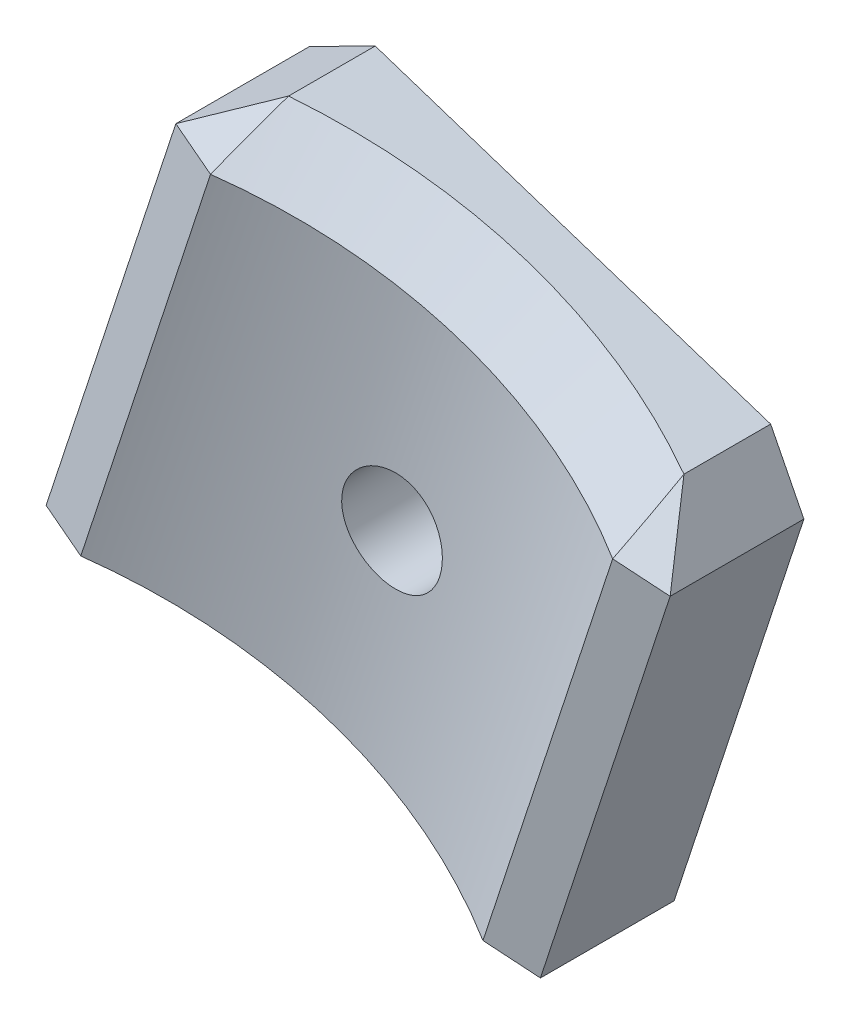
ISO-10303-21;
HEADER;
FILE_DESCRIPTION(('STEP AP214'),'2;1');
FILE_NAME('part.step','',(''),(''),'','','');
FILE_SCHEMA(('AUTOMOTIVE_DESIGN { 1 0 10303 214 1 1 1 1 }'));
ENDSEC;
DATA;
#1=APPLICATION_CONTEXT('core data for automotive mechanical design processes');
#2=APPLICATION_PROTOCOL_DEFINITION('international standard','automotive_design',2000,#1);
#3=PRODUCT_CONTEXT('',#1,'mechanical');
#4=PRODUCT('Part','Part','',(#3));
#5=PRODUCT_RELATED_PRODUCT_CATEGORY('part','',(#4));
#6=PRODUCT_DEFINITION_FORMATION('','',#4);
#7=PRODUCT_DEFINITION_CONTEXT('part definition',#1,'design');
#8=PRODUCT_DEFINITION('design','',#6,#7);
#9=PRODUCT_DEFINITION_SHAPE('','',#8);
#10=(LENGTH_UNIT() NAMED_UNIT(*) SI_UNIT(.MILLI.,.METRE.));
#11=(NAMED_UNIT(*) PLANE_ANGLE_UNIT() SI_UNIT($,.RADIAN.));
#12=(NAMED_UNIT(*) SI_UNIT($,.STERADIAN.) SOLID_ANGLE_UNIT());
#13=UNCERTAINTY_MEASURE_WITH_UNIT(LENGTH_MEASURE(1.E-05),#10,'distance_accuracy_value','');
#14=(GEOMETRIC_REPRESENTATION_CONTEXT(3) GLOBAL_UNCERTAINTY_ASSIGNED_CONTEXT((#13)) GLOBAL_UNIT_ASSIGNED_CONTEXT((#10,
#11,#12)) REPRESENTATION_CONTEXT('',''));
#15=CARTESIAN_POINT('',(0.,0.,0.));
#16=DIRECTION('',(0.,0.,1.));
#17=DIRECTION('',(1.,0.,0.));
#18=AXIS2_PLACEMENT_3D('',#15,#16,#17);
#19=CARTESIAN_POINT('',(547.424516318284,690.435860085161,53.0235000000035));
#20=DIRECTION('',(0.950182883020468,-0.311692939950418,0.));
#21=DIRECTION('',(0.311692939950418,0.950182883020468,0.));
#22=AXIS2_PLACEMENT_3D('',#19,#20,#21);
#23=PLANE('',#22);
#24=DIRECTION('',(-0.311692939950418,-0.950182883020468,0.));
#25=VECTOR('',#24,1.);
#26=CARTESIAN_POINT('',(547.424516318281,690.435860085164,2.4980018054066E-13));
#27=LINE('',#26,#25);
#28=CARTESIAN_POINT('',(554.549816925545,712.157040790999,8.32667268468867E-13));
#29=VERTEX_POINT('',#28);
#30=CARTESIAN_POINT('',(548.216216385755,692.849324608031,0.));
#31=VERTEX_POINT('',#30);
#32=EDGE_CURVE('E118',#29,#31,#27,.T.);
#33=ORIENTED_EDGE('',*,*,#32,.T.);
#34=DIRECTION('',(0.,0.,1.));
#35=VECTOR('',#34,1.);
#36=CARTESIAN_POINT('',(548.216216385763,692.849324608026,53.0235000000039));
#37=LINE('',#36,#35);
#38=CARTESIAN_POINT('',(548.216216385755,692.849324608031,6.52990307379059));
#39=VERTEX_POINT('',#38);
#40=EDGE_CURVE('E213',#31,#39,#37,.T.);
#41=ORIENTED_EDGE('',*,*,#40,.T.);
#42=DIRECTION('',(0.311692939950418,0.950182883020468,0.));
#43=VECTOR('',#42,1.);
#44=CARTESIAN_POINT('',(547.42451631828,690.435860085164,6.52990307379123));
#45=LINE('',#44,#43);
#46=CARTESIAN_POINT('',(554.549816925544,712.157040791,6.52990307379059));
#47=VERTEX_POINT('',#46);
#48=EDGE_CURVE('E121',#39,#47,#45,.T.);
#49=ORIENTED_EDGE('',*,*,#48,.T.);
#50=DIRECTION('',(0.,0.,-1.));
#51=VECTOR('',#50,1.);
#52=CARTESIAN_POINT('',(554.549816925546,712.157040790998,53.0235000000032));
#53=LINE('',#52,#51);
#54=EDGE_CURVE('E116',#47,#29,#53,.T.);
#55=ORIENTED_EDGE('',*,*,#54,.T.);
#56=EDGE_LOOP('',(#33,#41,#49,#55));
#57=FACE_BOUND('',#56,.T.);
#58=ADVANCED_FACE('F34',(#57),#23,.F.);
#59=CARTESIAN_POINT('',(547.424516318284,690.435860085161,53.0235000000035));
#60=DIRECTION('',(0.31169293995041,0.95018288302047,0.));
#61=DIRECTION('',(-0.95018288302047,0.31169293995041,0.));
#62=AXIS2_PLACEMENT_3D('',#59,#60,#61);
#63=PLANE('',#62);
#64=DIRECTION('',(0.95018288302047,-0.311692939950411,0.));
#65=VECTOR('',#64,1.);
#66=CARTESIAN_POINT('',(547.424516318281,690.435860085164,2.4980018054066E-13));
#67=LINE('',#66,#65);
#68=CARTESIAN_POINT('',(549.837980841156,689.644160017678,5.55111512312578E-13));
#69=VERTEX_POINT('',#68);
#70=CARTESIAN_POINT('',(569.145697024126,683.310559477886,4.71844785465692E-13));
#71=VERTEX_POINT('',#70);
#72=EDGE_CURVE('E135',#69,#71,#67,.T.);
#73=ORIENTED_EDGE('',*,*,#72,.T.);
#74=DIRECTION('',(0.,0.,1.));
#75=VECTOR('',#74,1.);
#76=CARTESIAN_POINT('',(569.145697024131,683.310559477886,53.0235000000045));
#77=LINE('',#76,#75);
#78=CARTESIAN_POINT('',(569.145697024129,683.31055947789,4.23356044453957));
#79=VERTEX_POINT('',#78);
#80=EDGE_CURVE('E154',#71,#79,#77,.T.);
#81=ORIENTED_EDGE('',*,*,#80,.T.);
#82=CARTESIAN_POINT('',(559.491838932644,686.477359747784,28.892500000003));
#83=DIRECTION('',(0.31169293995041,0.95018288302047,0.));
#84=DIRECTION('',(-0.95018288302047,0.31169293995041,0.));
#85=AXIS2_PLACEMENT_3D('',#82,#83,#84);
#86=CIRCLE('',#85,26.6700000000001);
#87=CARTESIAN_POINT('',(549.837980841155,689.644160017679,4.23356044454115));
#88=VERTEX_POINT('',#87);
#89=EDGE_CURVE('E152',#79,#88,#86,.T.);
#90=ORIENTED_EDGE('',*,*,#89,.T.);
#91=DIRECTION('',(0.,0.,-1.));
#92=VECTOR('',#91,1.);
#93=CARTESIAN_POINT('',(549.837980841159,689.644160017676,53.0235000000035));
#94=LINE('',#93,#92);
#95=EDGE_CURVE('E150',#88,#69,#94,.T.);
#96=ORIENTED_EDGE('',*,*,#95,.T.);
#97=EDGE_LOOP('',(#73,#81,#90,#96));
#98=FACE_BOUND('',#97,.T.);
#99=ADVANCED_FACE('F207',(#98),#63,.F.);
#100=CARTESIAN_POINT('',(571.559161547005,682.518859410415,53.0235000000039));
#101=DIRECTION('',(-0.950182883020469,0.311692939950413,0.));
#102=DIRECTION('',(-0.311692939950413,-0.950182883020469,0.));
#103=AXIS2_PLACEMENT_3D('',#100,#101,#102);
#104=PLANE('',#103);
#105=DIRECTION('',(-0.311692939950413,-0.950182883020469,0.));
#106=VECTOR('',#105,1.);
#107=CARTESIAN_POINT('',(571.559161546999,682.518859410415,6.52990307377979));
#108=LINE('',#107,#106);
#109=CARTESIAN_POINT('',(578.684462154264,704.240040116271,6.52990307377963));
#110=VERTEX_POINT('',#109);
#111=CARTESIAN_POINT('',(572.350861614473,684.932323933281,6.52990307377954));
#112=VERTEX_POINT('',#111);
#113=EDGE_CURVE('E143',#110,#112,#108,.T.);
#114=ORIENTED_EDGE('',*,*,#113,.T.);
#115=DIRECTION('',(0.,0.,-1.));
#116=VECTOR('',#115,1.);
#117=CARTESIAN_POINT('',(572.350861614482,684.93232393328,53.0235000000039));
#118=LINE('',#117,#116);
#119=CARTESIAN_POINT('',(572.350861614479,684.932323933285,0.));
#120=VERTEX_POINT('',#119);
#121=EDGE_CURVE('E140',#112,#120,#118,.T.);
#122=ORIENTED_EDGE('',*,*,#121,.T.);
#123=DIRECTION('',(0.311692939950412,0.950182883020468,0.));
#124=VECTOR('',#123,1.);
#125=CARTESIAN_POINT('',(571.559161546999,682.518859410416,0.));
#126=LINE('',#125,#124);
#127=CARTESIAN_POINT('',(578.684462154264,704.240040116271,-3.60822483003176E-13));
#128=VERTEX_POINT('',#127);
#129=EDGE_CURVE('E234',#120,#128,#126,.T.);
#130=ORIENTED_EDGE('',*,*,#129,.T.);
#131=DIRECTION('',(0.,0.,1.));
#132=VECTOR('',#131,1.);
#133=CARTESIAN_POINT('',(578.684462154269,704.240040116267,53.0235000000031));
#134=LINE('',#133,#132);
#135=EDGE_CURVE('E224',#128,#110,#134,.T.);
#136=ORIENTED_EDGE('',*,*,#135,.T.);
#137=EDGE_LOOP('',(#114,#122,#130,#136));
#138=FACE_BOUND('',#137,.T.);
#139=ADVANCED_FACE('F227',(#138),#104,.F.);
#140=CARTESIAN_POINT('',(555.341516993028,714.570505313869,53.0235000000042));
#141=DIRECTION('',(-0.311692939950411,-0.950182883020469,0.));
#142=DIRECTION('',(0.95018288302047,-0.311692939950411,0.));
#143=AXIS2_PLACEMENT_3D('',#140,#141,#142);
#144=PLANE('',#143);
#145=CARTESIAN_POINT('',(567.408839607383,710.612004976515,28.8925000000044));
#146=DIRECTION('',(-0.311692939950411,-0.950182883020469,0.));
#147=DIRECTION('',(0.95018288302047,-0.311692939950411,0.));
#148=AXIS2_PLACEMENT_3D('',#145,#146,#147);
#149=CIRCLE('',#148,26.6699999999996);
#150=CARTESIAN_POINT('',(557.754981515894,713.778805246408,4.23356044454082));
#151=VERTEX_POINT('',#150);
#152=CARTESIAN_POINT('',(577.062697698872,707.445204706604,4.23356044453849));
#153=VERTEX_POINT('',#152);
#154=EDGE_CURVE('E48',#151,#153,#149,.T.);
#155=ORIENTED_EDGE('',*,*,#154,.T.);
#156=DIRECTION('',(0.,0.,-1.));
#157=VECTOR('',#156,1.);
#158=CARTESIAN_POINT('',(577.062697698871,707.445204706602,53.0235000000042));
#159=LINE('',#158,#157);
#160=CARTESIAN_POINT('',(577.062697698872,707.445204706604,-4.44089209850063E-13));
#161=VERTEX_POINT('',#160);
#162=EDGE_CURVE('E11',#153,#161,#159,.T.);
#163=ORIENTED_EDGE('',*,*,#162,.T.);
#164=DIRECTION('',(-0.95018288302047,0.311692939950411,0.));
#165=VECTOR('',#164,1.);
#166=CARTESIAN_POINT('',(555.341516993019,714.570505313873,2.4980018054066E-13));
#167=LINE('',#166,#165);
#168=CARTESIAN_POINT('',(557.754981515895,713.778805246408,4.44089209850063E-13));
#169=VERTEX_POINT('',#168);
#170=EDGE_CURVE('E125',#161,#169,#167,.T.);
#171=ORIENTED_EDGE('',*,*,#170,.T.);
#172=DIRECTION('',(0.,0.,1.));
#173=VECTOR('',#172,1.);
#174=CARTESIAN_POINT('',(557.754981515893,713.778805246396,53.0235000000052));
#175=LINE('',#174,#173);
#176=EDGE_CURVE('E59',#169,#151,#175,.T.);
#177=ORIENTED_EDGE('',*,*,#176,.T.);
#178=EDGE_LOOP('',(#155,#163,#171,#177));
#179=FACE_BOUND('',#178,.T.);
#180=ADVANCED_FACE('F302',(#179),#144,.F.);
#181=CARTESIAN_POINT('',(0.,0.,0.));
#182=DIRECTION('',(0.,0.,1.));
#183=DIRECTION('',(1.00000000000002,0.,0.));
#184=AXIS2_PLACEMENT_3D('',#181,#182,#183);
#185=PLANE('',#184);
#186=CARTESIAN_POINT('',(563.450339270016,698.544682362145,9.71445146547012E-13));
#187=DIRECTION('',(0.,0.,-1.));
#188=DIRECTION('',(-1.00000000000002,0.,0.));
#189=AXIS2_PLACEMENT_3D('',#186,#187,#188);
#190=CIRCLE('',#189,2.45744999999997);
#191=CARTESIAN_POINT('',(560.992889270016,698.544682362145,9.71445146547012E-13));
#192=VERTEX_POINT('',#191);
#193=EDGE_CURVE('E239',#192,#192,#190,.T.);
#194=ORIENTED_EDGE('',*,*,#193,.F.);
#195=EDGE_LOOP('',(#194));
#196=FACE_BOUND('',#195,.T.);
#197=ORIENTED_EDGE('',*,*,#129,.F.);
#198=DIRECTION('',(0.892280951438055,0.451480568464285,0.));
#199=VECTOR('',#198,1.);
#200=CARTESIAN_POINT('',(572.350861614479,684.932323933285,0.));
#201=LINE('',#200,#199);
#202=EDGE_CURVE('E148',#120,#71,#201,.F.);
#203=ORIENTED_EDGE('',*,*,#202,.T.);
#204=ORIENTED_EDGE('',*,*,#72,.F.);
#205=DIRECTION('',(0.451480568464216,-0.892280951438082,0.));
#206=VECTOR('',#205,1.);
#207=CARTESIAN_POINT('',(549.837980841156,689.644160017678,5.55111512312578E-13));
#208=LINE('',#207,#206);
#209=EDGE_CURVE('E134',#69,#31,#208,.F.);
#210=ORIENTED_EDGE('',*,*,#209,.T.);
#211=ORIENTED_EDGE('',*,*,#32,.F.);
#212=DIRECTION('',(-0.892280951438082,-0.451480568464216,0.));
#213=VECTOR('',#212,1.);
#214=CARTESIAN_POINT('',(554.549816925545,712.157040790999,8.32667268468867E-13));
#215=LINE('',#214,#213);
#216=EDGE_CURVE('E131',#29,#169,#215,.F.);
#217=ORIENTED_EDGE('',*,*,#216,.T.);
#218=ORIENTED_EDGE('',*,*,#170,.F.);
#219=DIRECTION('',(-0.451480568464285,0.892280951438055,0.));
#220=VECTOR('',#219,1.);
#221=CARTESIAN_POINT('',(577.062697698872,707.445204706604,-4.44089209850063E-13));
#222=LINE('',#221,#220);
#223=EDGE_CURVE('E139',#161,#128,#222,.F.);
#224=ORIENTED_EDGE('',*,*,#223,.T.);
#225=EDGE_LOOP('',(#197,#203,#204,#210,#211,#217,#218,#224));
#226=FACE_BOUND('',#225,.T.);
#227=ADVANCED_FACE('F129',(#196,#226),#185,.F.);
#228=CARTESIAN_POINT('',(488.238832859981,469.265552689304,28.8925000000039));
#229=DIRECTION('',(0.311692939950409,0.95018288302047,0.));
#230=DIRECTION('',(-0.950182883020471,0.311692939950409,0.));
#231=AXIS2_PLACEMENT_3D('',#228,#229,#230);
#232=CYLINDRICAL_SURFACE('',#231,24.13);
#233=CARTESIAN_POINT('',(560.992889270013,698.544682362146,4.87574440613911));
#234=CARTESIAN_POINT('',(560.992895065936,698.682060351215,4.87990607011413));
#235=CARTESIAN_POINT('',(561.004446642199,698.819555677246,4.88311507000165));
#236=CARTESIAN_POINT('',(561.050389035067,699.0908139292,4.8872547520252));
#237=CARTESIAN_POINT('',(561.084803520039,699.224572837383,4.88818306844577));
#238=CARTESIAN_POINT('',(561.175498984302,699.484406738174,4.88765192176657));
#239=CARTESIAN_POINT('',(561.231771238519,699.610484773595,4.88619341068325));
#240=CARTESIAN_POINT('',(561.364560158319,699.85139711192,4.88105609955481));
#241=CARTESIAN_POINT('',(561.441072740221,699.966233676503,4.8773777471924));
#242=CARTESIAN_POINT('',(561.612196203628,700.181509934066,4.86821598610572));
#243=CARTESIAN_POINT('',(561.706814224813,700.281943920124,4.8627318646794));
#244=CARTESIAN_POINT('',(561.911457757064,700.465569133202,4.8505756326235));
#245=CARTESIAN_POINT('',(562.0214842262,700.548759287234,4.84390344811528));
#246=CARTESIAN_POINT('',(562.254394309057,700.695923394984,4.83008547655725));
#247=CARTESIAN_POINT('',(562.37733416679,700.759808155977,4.82293767198667));
#248=CARTESIAN_POINT('',(562.632206479874,700.866057364993,4.80899826031349));
#249=CARTESIAN_POINT('',(562.764139039581,700.908421563231,4.80220665734608));
#250=CARTESIAN_POINT('',(563.033550072471,700.970479296857,4.78972957535689));
#251=CARTESIAN_POINT('',(563.171038556805,700.990129830411,4.78404621131594));
#252=CARTESIAN_POINT('',(563.447422948216,701.006025653145,4.77444300158368));
#253=CARTESIAN_POINT('',(563.586318816338,701.00227158838,4.7705231072171));
#254=CARTESIAN_POINT('',(563.861034354186,700.971495772895,4.76490067213209));
#255=CARTESIAN_POINT('',(563.9968634992,700.944560105297,4.76318998638369));
#256=CARTESIAN_POINT('',(564.262089093109,700.86829206038,4.76215195019387));
#257=CARTESIAN_POINT('',(564.391485687016,700.818960188202,4.76282454600052));
#258=CARTESIAN_POINT('',(564.639711809547,700.699527610958,4.76647061714793));
#259=CARTESIAN_POINT('',(564.75857675163,700.629500231368,4.7694360278684));
#260=CARTESIAN_POINT('',(564.982898496913,700.470614556305,4.77732651577939));
#261=CARTESIAN_POINT('',(565.088355112141,700.381755996882,4.7822516204391));
#262=CARTESIAN_POINT('',(565.28312264081,700.187521789525,4.79352504446065));
#263=CARTESIAN_POINT('',(565.37239889022,700.082111562491,4.79987635562143));
#264=CARTESIAN_POINT('',(565.53205195251,699.857875788212,4.81328822073119));
#265=CARTESIAN_POINT('',(565.602428188891,699.73904983191,4.82034879630557));
#266=CARTESIAN_POINT('',(565.722592828625,699.490743826831,4.83442367003447));
#267=CARTESIAN_POINT('',(565.772287806944,699.361218532471,4.84143762029743));
#268=CARTESIAN_POINT('',(565.849223358974,699.095618797895,4.85459600938349));
#269=CARTESIAN_POINT('',(565.876463954554,698.959544364059,4.86074044905344));
#270=CARTESIAN_POINT('',(565.907691425873,698.684704095567,4.87146210778373));
#271=CARTESIAN_POINT('',(565.911680869059,698.545938559767,4.87603949982864));
#272=CARTESIAN_POINT('',(565.896267171913,698.26965973996,4.88310477240917));
#273=CARTESIAN_POINT('',(565.876864780423,698.132146416009,4.88559271982991));
#274=CARTESIAN_POINT('',(565.815346793981,697.862936084758,4.88818756750327));
#275=CARTESIAN_POINT('',(565.773335212084,697.731215406998,4.88830527745109));
#276=CARTESIAN_POINT('',(565.667863990216,697.476683366093,4.88617394102547));
#277=CARTESIAN_POINT('',(565.604404609649,697.353871895216,4.88392492327621));
#278=CARTESIAN_POINT('',(565.457999199269,697.120863819091,4.87732271640669));
#279=CARTESIAN_POINT('',(565.375090085115,697.01064389717,4.87297349712554));
#280=CARTESIAN_POINT('',(565.192078119436,696.805634279222,4.86266354609938));
#281=CARTESIAN_POINT('',(565.09197482819,696.710844977936,4.85670277313853));
#282=CARTESIAN_POINT('',(564.876988698542,696.53900551744,4.84381361262705));
#283=CARTESIAN_POINT('',(564.762051979973,696.462023034894,4.83688168925464));
#284=CARTESIAN_POINT('',(564.520916466754,696.328395677815,4.82284491526552));
#285=CARTESIAN_POINT('',(564.394717413737,696.271751270007,4.81574006068433));
#286=CARTESIAN_POINT('',(564.134122334754,696.180229135567,4.80212800865606));
#287=CARTESIAN_POINT('',(563.999698940984,696.145428966467,4.79562300991888));
#288=CARTESIAN_POINT('',(563.726856552219,696.098920869483,4.78397195141909));
#289=CARTESIAN_POINT('',(563.58843761123,696.087212629623,4.77882587329806));
#290=CARTESIAN_POINT('',(563.311840581362,696.087252101756,4.77048270968234));
#291=CARTESIAN_POINT('',(563.173662615882,696.098949345911,4.76728145009533));
#292=CARTESIAN_POINT('',(562.901201326076,696.145389861452,4.76317191433182));
#293=CARTESIAN_POINT('',(562.766917889449,696.180132467626,4.76226357197318));
#294=CARTESIAN_POINT('',(562.506677797271,696.271469459211,4.76284100275296));
#295=CARTESIAN_POINT('',(562.380686883262,696.327966340428,4.76431618574092));
#296=CARTESIAN_POINT('',(562.139962042199,696.46120059262,4.76947518627978));
#297=CARTESIAN_POINT('',(562.02522774104,696.537937290625,4.77315893040164));
#298=CARTESIAN_POINT('',(561.810232341827,696.70946467743,4.78232358985874));
#299=CARTESIAN_POINT('',(561.709972272656,696.804256648555,4.78780463286215));
#300=CARTESIAN_POINT('',(561.526702433393,697.009239043729,4.79995488453705));
#301=CARTESIAN_POINT('',(561.443697037895,697.119433360934,4.80662439372749));
#302=CARTESIAN_POINT('',(561.29690328482,697.352682469397,4.82044299734513));
#303=CARTESIAN_POINT('',(561.233212196629,697.475798285278,4.82759430459447));
#304=CARTESIAN_POINT('',(561.127443246754,697.730900150482,4.84153737236222));
#305=CARTESIAN_POINT('',(561.085342222772,697.862876521313,4.84832951115609));
#306=CARTESIAN_POINT('',(561.03411809867,698.087062532109,4.85871481843805));
#307=CARTESIAN_POINT('',(561.018680396769,698.177865160092,4.86261966830225));
#308=CARTESIAN_POINT('',(560.998064034978,698.360655088922,4.86974035482377));
#309=CARTESIAN_POINT('',(560.992885386883,698.452642391131,4.87295619068892));
#310=CARTESIAN_POINT('',(560.992889270013,698.544682362146,4.87574440613911));
#311=B_SPLINE_CURVE_WITH_KNOTS('',3,(#233,#234,#235,#236,#237,#238,#239,#240,#241,#242,#243,
#244,#245,#246,#247,#248,#249,#250,#251,#252,#253,#254,#255,#256,#257,#258,#259,#260,#261,#262,
#263,#264,#265,#266,#267,#268,#269,#270,#271,#272,#273,#274,#275,#276,#277,#278,#279,#280,#281,
#282,#283,#284,#285,#286,#287,#288,#289,#290,#291,#292,#293,#294,#295,#296,#297,#298,#299,#300,
#301,#302,#303,#304,#305,#306,#307,#308,#309,#310),.UNSPECIFIED.,.T.,.F.,(4,2,2,2,2,2,2,2,2,2,2,
2,2,2,2,2,2,2,2,2,2,2,2,2,2,2,2,2,2,2,2,2,2,2,2,2,2,2,4),(0.,0.411989155856427,
0.824405481196291,1.23665734913689,1.64882610465291,2.06115773056834,2.47351500591933,
2.8877492660322,3.30198833398512,3.71701036731724,4.13202094451226,4.54549702849523,
4.95896378710312,5.37098281978735,5.78300762797684,6.19590496481084,6.6088148946634,
7.02357036140455,7.43832542418988,7.85303468786676,8.26773067580033,8.68053497242628,
9.09333427648333,9.50535633609323,9.91738893425411,10.3309626772307,10.7445459104088,
11.1595893779861,11.5746272382157,11.98877114167,12.4029030912501,12.8152000813675,
13.2274833644165,13.6397959396724,14.0522129217846,14.4666736566949,14.8806888138544,
15.1567113894066,15.4327342823084),.UNSPECIFIED.);
#312=CARTESIAN_POINT('',(560.992889270013,698.544682362146,4.87574440613911));
#313=VERTEX_POINT('',#312);
#314=EDGE_CURVE('E38',#313,#313,#311,.T.);
#315=ORIENTED_EDGE('',*,*,#314,.T.);
#316=EDGE_LOOP('',(#315));
#317=FACE_BOUND('',#316,.T.);
#318=DIRECTION('',(0.311692939950409,0.95018288302047,0.));
#319=VECTOR('',#318,1.);
#320=CARTESIAN_POINT('',(478.420459098405,472.486319804736,7.08692511957099));
#321=LINE('',#320,#319);
#322=CARTESIAN_POINT('',(556.798765778342,711.41930756906,7.08692511956927));
#323=VERTEX_POINT('',#322);
#324=CARTESIAN_POINT('',(550.465165238544,692.111591386087,7.08692511956868));
#325=VERTEX_POINT('',#324);
#326=EDGE_CURVE('E221',#323,#325,#321,.F.);
#327=ORIENTED_EDGE('',*,*,#326,.T.);
#328=CARTESIAN_POINT('',(560.28353900012,688.890824270665,28.8925000000034));
#329=DIRECTION('',(0.31169293995042,0.950182883020468,0.));
#330=DIRECTION('',(-0.950182883020468,0.31169293995042,0.));
#331=AXIS2_PLACEMENT_3D('',#328,#329,#330);
#332=CIRCLE('',#331,24.13);
#333=CARTESIAN_POINT('',(570.101912761679,685.670057155227,7.08692511956197));
#334=VERTEX_POINT('',#333);
#335=EDGE_CURVE('E202',#325,#334,#332,.F.);
#336=ORIENTED_EDGE('',*,*,#335,.T.);
#337=DIRECTION('',(0.311692939950409,0.95018288302047,0.));
#338=VECTOR('',#337,1.);
#339=CARTESIAN_POINT('',(498.057206621539,466.04478557388,7.08692511956138));
#340=LINE('',#339,#338);
#341=CARTESIAN_POINT('',(576.435513301466,704.977773338213,7.08692511956144));
#342=VERTEX_POINT('',#341);
#343=EDGE_CURVE('E216',#334,#342,#340,.T.);
#344=ORIENTED_EDGE('',*,*,#343,.T.);
#345=CARTESIAN_POINT('',(566.617139539906,708.198540453635,28.8925000000035));
#346=DIRECTION('',(-0.311692939950381,-0.950182883020482,0.));
#347=DIRECTION('',(0.950182883020483,-0.311692939950381,0.));
#348=AXIS2_PLACEMENT_3D('',#345,#346,#347);
#349=CIRCLE('',#348,24.13);
#350=EDGE_CURVE('E214',#342,#323,#349,.F.);
#351=ORIENTED_EDGE('',*,*,#350,.T.);
#352=EDGE_LOOP('',(#327,#336,#344,#351));
#353=FACE_BOUND('',#352,.T.);
#354=ADVANCED_FACE('F246',(#317,#353),#232,.F.);
#355=CARTESIAN_POINT('',(572.350861614482,684.93232393328,53.0235000000039));
#356=DIRECTION('',(-0.451480568464285,0.892280951438055,0.));
#357=DIRECTION('',(0.,0.,-1.));
#358=AXIS2_PLACEMENT_3D('',#355,#356,#357);
#359=PLANE('',#358);
#360=ORIENTED_EDGE('',*,*,#202,.F.);
#361=ORIENTED_EDGE('',*,*,#121,.F.);
#362=DIRECTION('',(-0.751789968135195,-0.380394271145647,-0.538620499322928));
#363=VECTOR('',#362,1.);
#364=CARTESIAN_POINT('',(572.350861614473,684.932323933281,6.52990307377954));
#365=LINE('',#364,#363);
#366=EDGE_CURVE('E186',#79,#112,#365,.F.);
#367=ORIENTED_EDGE('',*,*,#366,.F.);
#368=ORIENTED_EDGE('',*,*,#80,.F.);
#369=EDGE_LOOP('',(#360,#361,#367,#368));
#370=FACE_BOUND('',#369,.T.);
#371=ADVANCED_FACE('F36',(#370),#359,.F.);
#372=CARTESIAN_POINT('',(577.062697698871,707.445204706602,53.0235000000042));
#373=DIRECTION('',(-0.892280951438055,-0.451480568464285,0.));
#374=DIRECTION('',(0.,0.,-1.));
#375=AXIS2_PLACEMENT_3D('',#372,#373,#374);
#376=PLANE('',#375);
#377=ORIENTED_EDGE('',*,*,#223,.F.);
#378=ORIENTED_EDGE('',*,*,#162,.F.);
#379=DIRECTION('',(0.380394271145669,-0.751789968135239,0.538620499322845));
#380=VECTOR('',#379,1.);
#381=CARTESIAN_POINT('',(578.262192483081,705.074590283633,5.9319889662369));
#382=LINE('',#381,#380);
#383=EDGE_CURVE('E183',#110,#153,#382,.F.);
#384=ORIENTED_EDGE('',*,*,#383,.F.);
#385=ORIENTED_EDGE('',*,*,#135,.F.);
#386=EDGE_LOOP('',(#377,#378,#384,#385));
#387=FACE_BOUND('',#386,.T.);
#388=ADVANCED_FACE('F295',(#387),#376,.F.);
#389=CARTESIAN_POINT('',(500.306155474338,465.307052351933,6.52990307378029));
#390=DIRECTION('',(0.21767148788066,-0.0714037973250243,0.973406708982113));
#391=DIRECTION('',(0.311692939950409,0.95018288302047,0.));
#392=AXIS2_PLACEMENT_3D('',#389,#390,#391);
#393=PLANE('',#392);
#394=DIRECTION('',(-0.924914393092099,0.303403998890067,0.229083781417653));
#395=VECTOR('',#394,1.);
#396=CARTESIAN_POINT('',(572.350861614473,684.932323933281,6.52990307377954));
#397=LINE('',#396,#395);
#398=EDGE_CURVE('E136',#112,#334,#397,.T.);
#399=ORIENTED_EDGE('',*,*,#398,.F.);
#400=ORIENTED_EDGE('',*,*,#113,.F.);
#401=DIRECTION('',(0.924914393092061,-0.303403998890184,-0.229083781417653));
#402=VECTOR('',#401,1.);
#403=CARTESIAN_POINT('',(576.435513301466,704.977773338213,7.08692511956144));
#404=LINE('',#403,#402);
#405=EDGE_CURVE('E180',#342,#110,#404,.T.);
#406=ORIENTED_EDGE('',*,*,#405,.F.);
#407=ORIENTED_EDGE('',*,*,#343,.F.);
#408=EDGE_LOOP('',(#399,#400,#406,#407));
#409=FACE_BOUND('',#408,.T.);
#410=ADVANCED_FACE('F293',(#409),#393,.T.);
#411=CARTESIAN_POINT('',(572.350861614473,684.932323933281,6.52990307377954));
#412=DIRECTION('',(-0.0857335772462297,-0.75351037176716,0.65182196447487));
#413=DIRECTION('',(0.,-0.654230777646813,-0.756294975244233));
#414=AXIS2_PLACEMENT_3D('',#411,#412,#413);
#415=PLANE('',#414);
#416=ORIENTED_EDGE('',*,*,#366,.T.);
#417=ORIENTED_EDGE('',*,*,#398,.T.);
#418=CARTESIAN_POINT('',(548.454461037679,678.074274202797,-4.54111922997458));
#419=DIRECTION('',(-0.0857335772462297,-0.75351037176716,0.65182196447487));
#420=DIRECTION('',(-0.370382395887947,-0.583239344606332,-0.722944498367258));
#421=AXIS2_PLACEMENT_3D('',#418,#419,#420);
#422=ELLIPSE('',#421,51.2925630803428,16.4769999741242);
#423=EDGE_CURVE('E177',#79,#334,#422,.T.);
#424=ORIENTED_EDGE('',*,*,#423,.F.);
#425=EDGE_LOOP('',(#416,#417,#424));
#426=FACE_BOUND('',#425,.T.);
#427=ADVANCED_FACE('F192',(#426),#415,.T.);
#428=CARTESIAN_POINT('',(576.435513301466,704.977773338213,7.08692511956144));
#429=DIRECTION('',(0.377252128600671,0.657882176452906,0.651821964474871));
#430=DIRECTION('',(0.,-0.703827349586413,0.710371073435678));
#431=AXIS2_PLACEMENT_3D('',#428,#429,#430);
#432=PLANE('',#431);
#433=ORIENTED_EDGE('',*,*,#405,.T.);
#434=ORIENTED_EDGE('',*,*,#383,.T.);
#435=CARTESIAN_POINT('',(563.493483817911,723.92010576195,-4.5411192300089));
#436=DIRECTION('',(0.377252128600671,0.657882176452906,0.651821964474871));
#437=DIRECTION('',(0.0470552538768471,0.689301860844108,-0.722944498367235));
#438=AXIS2_PLACEMENT_3D('',#435,#436,#437);
#439=ELLIPSE('',#438,51.2925630803933,16.4769999741314);
#440=EDGE_CURVE('E174',#342,#153,#439,.T.);
#441=ORIENTED_EDGE('',*,*,#440,.F.);
#442=EDGE_LOOP('',(#433,#434,#441));
#443=FACE_BOUND('',#442,.T.);
#444=ADVANCED_FACE('F287',(#443),#432,.T.);
#445=CARTESIAN_POINT('',(559.491838932645,686.477359747785,28.892500000003));
#446=DIRECTION('',(-0.31169293995042,-0.950182883020468,0.));
#447=DIRECTION('',(0.950182883020468,-0.31169293995042,0.));
#448=AXIS2_PLACEMENT_3D('',#445,#446,#447);
#449=CONICAL_SURFACE('',#448,26.67,0.785398163397422);
#450=ORIENTED_EDGE('',*,*,#423,.T.);
#451=ORIENTED_EDGE('',*,*,#335,.F.);
#452=CARTESIAN_POINT('',(563.407194722147,673.16925896301,-4.54111922936665));
#453=DIRECTION('',(-0.377252128600179,-0.657882176453925,0.651821964474103));
#454=DIRECTION('',(-0.0470552538770388,-0.689301860843076,-0.722944498368204));
#455=AXIS2_PLACEMENT_3D('',#452,#453,#454);
#456=ELLIPSE('',#455,51.2925630794702,16.4769999740402);
#457=EDGE_CURVE('E171',#88,#325,#456,.F.);
#458=ORIENTED_EDGE('',*,*,#457,.F.);
#459=ORIENTED_EDGE('',*,*,#89,.F.);
#460=EDGE_LOOP('',(#450,#451,#458,#459));
#461=FACE_BOUND('',#460,.T.);
#462=ADVANCED_FACE('F200',(#461),#449,.F.);
#463=CARTESIAN_POINT('',(549.837980841159,689.644160017676,53.0235000000035));
#464=DIRECTION('',(0.892280951438081,0.451480568464216,0.));
#465=DIRECTION('',(0.,0.,-1.));
#466=AXIS2_PLACEMENT_3D('',#463,#464,#465);
#467=PLANE('',#466);
#468=ORIENTED_EDGE('',*,*,#209,.F.);
#469=ORIENTED_EDGE('',*,*,#95,.F.);
#470=DIRECTION('',(-0.380394271145174,0.751789968134384,0.538620499324391));
#471=VECTOR('',#470,1.);
#472=CARTESIAN_POINT('',(548.638486056951,692.014774440668,5.93198896624964));
#473=LINE('',#472,#471);
#474=EDGE_CURVE('E168',#39,#88,#473,.F.);
#475=ORIENTED_EDGE('',*,*,#474,.F.);
#476=ORIENTED_EDGE('',*,*,#40,.F.);
#477=EDGE_LOOP('',(#468,#469,#475,#476));
#478=FACE_BOUND('',#477,.T.);
#479=ADVANCED_FACE('F211',(#478),#467,.F.);
#480=CARTESIAN_POINT('',(554.549816925546,712.157040790998,53.0235000000032));
#481=DIRECTION('',(0.451480568464216,-0.892280951438081,0.));
#482=DIRECTION('',(0.,0.,-1.));
#483=AXIS2_PLACEMENT_3D('',#480,#481,#482);
#484=PLANE('',#483);
#485=ORIENTED_EDGE('',*,*,#216,.F.);
#486=ORIENTED_EDGE('',*,*,#54,.F.);
#487=DIRECTION('',(0.75178996813443,0.380394271145193,-0.53862049932431));
#488=VECTOR('',#487,1.);
#489=CARTESIAN_POINT('',(554.549816925544,712.157040791,6.52990307379059));
#490=LINE('',#489,#488);
#491=EDGE_CURVE('E165',#151,#47,#490,.F.);
#492=ORIENTED_EDGE('',*,*,#491,.F.);
#493=ORIENTED_EDGE('',*,*,#176,.F.);
#494=EDGE_LOOP('',(#485,#486,#492,#493));
#495=FACE_BOUND('',#494,.T.);
#496=ADVANCED_FACE('F138',(#495),#484,.F.);
#497=CARTESIAN_POINT('',(567.408839607383,710.612004976515,28.8925000000044));
#498=DIRECTION('',(0.311692939950381,0.950182883020482,0.));
#499=DIRECTION('',(-0.950182883020483,0.311692939950381,0.));
#500=AXIS2_PLACEMENT_3D('',#497,#498,#499);
#501=CONICAL_SURFACE('',#500,26.6700000000001,0.785398163397454);
#502=ORIENTED_EDGE('',*,*,#440,.T.);
#503=ORIENTED_EDGE('',*,*,#154,.F.);
#504=CARTESIAN_POINT('',(578.446217502021,719.015090521005,-4.54111922941682));
#505=DIRECTION('',(0.0857335772472497,0.753510371767647,0.651821964474197));
#506=DIRECTION('',(0.370382395887123,0.583239344605707,-0.722944498368188));
#507=AXIS2_PLACEMENT_3D('',#504,#505,#506);
#508=ELLIPSE('',#507,51.2925630795366,16.476999974042);
#509=EDGE_CURVE('E162',#323,#151,#508,.F.);
#510=ORIENTED_EDGE('',*,*,#509,.F.);
#511=ORIENTED_EDGE('',*,*,#350,.F.);
#512=EDGE_LOOP('',(#502,#503,#510,#511));
#513=FACE_BOUND('',#512,.T.);
#514=ADVANCED_FACE('F276',(#513),#501,.F.);
#515=CARTESIAN_POINT('',(550.465165238544,692.111591386087,7.08692511956868));
#516=DIRECTION('',(-0.377252128600179,-0.657882176453925,0.651821964474103));
#517=DIRECTION('',(0.,-0.703827349585444,-0.710371073436672));
#518=AXIS2_PLACEMENT_3D('',#515,#516,#517);
#519=PLANE('',#518);
#520=ORIENTED_EDGE('',*,*,#474,.T.);
#521=ORIENTED_EDGE('',*,*,#457,.T.);
#522=DIRECTION('',(0.924914393092277,-0.303403998890025,0.229083781417025));
#523=VECTOR('',#522,1.);
#524=CARTESIAN_POINT('',(550.465165238544,692.111591386087,7.08692511956868));
#525=LINE('',#524,#523);
#526=EDGE_CURVE('E160',#39,#325,#525,.T.);
#527=ORIENTED_EDGE('',*,*,#526,.F.);
#528=EDGE_LOOP('',(#520,#521,#527));
#529=FACE_BOUND('',#528,.T.);
#530=ADVANCED_FACE('F272',(#529),#519,.T.);
#531=CARTESIAN_POINT('',(554.549816925544,712.157040791,6.52990307379059));
#532=DIRECTION('',(0.0857335772472497,0.753510371767647,0.651821964474197));
#533=DIRECTION('',(0.,-0.654230777646196,0.756294975244746));
#534=AXIS2_PLACEMENT_3D('',#531,#532,#533);
#535=PLANE('',#534);
#536=ORIENTED_EDGE('',*,*,#509,.T.);
#537=ORIENTED_EDGE('',*,*,#491,.T.);
#538=DIRECTION('',(-0.924914393092149,0.303403998890384,-0.229083781417025));
#539=VECTOR('',#538,1.);
#540=CARTESIAN_POINT('',(554.549816925544,712.157040791,6.52990307379059));
#541=LINE('',#540,#539);
#542=EDGE_CURVE('E158',#323,#47,#541,.T.);
#543=ORIENTED_EDGE('',*,*,#542,.F.);
#544=EDGE_LOOP('',(#536,#537,#543));
#545=FACE_BOUND('',#544,.T.);
#546=ADVANCED_FACE('F255',(#545),#535,.T.);
#547=CARTESIAN_POINT('',(476.171510245616,473.224053026677,6.52990307379031));
#548=DIRECTION('',(0.217671487880059,-0.0714037973248306,-0.973406708982262));
#549=DIRECTION('',(0.311692939950409,0.95018288302047,0.));
#550=AXIS2_PLACEMENT_3D('',#547,#548,#549);
#551=PLANE('',#550);
#552=ORIENTED_EDGE('',*,*,#526,.T.);
#553=ORIENTED_EDGE('',*,*,#326,.F.);
#554=ORIENTED_EDGE('',*,*,#542,.T.);
#555=ORIENTED_EDGE('',*,*,#48,.F.);
#556=EDGE_LOOP('',(#552,#553,#554,#555));
#557=FACE_BOUND('',#556,.T.);
#558=ADVANCED_FACE('F251',(#557),#551,.F.);
#559=CARTESIAN_POINT('',(563.450339270016,698.544682362145,9.71445146547012E-13));
#560=DIRECTION('',(0.,0.,-1.));
#561=DIRECTION('',(-1.00000000000002,0.,0.));
#562=AXIS2_PLACEMENT_3D('',#559,#560,#561);
#563=CYLINDRICAL_SURFACE('',#562,2.45744999999997);
#564=ORIENTED_EDGE('',*,*,#193,.T.);
#565=EDGE_LOOP('',(#564));
#566=FACE_BOUND('',#565,.T.);
#567=ORIENTED_EDGE('',*,*,#314,.F.);
#568=EDGE_LOOP('',(#567));
#569=FACE_BOUND('',#568,.T.);
#570=ADVANCED_FACE('F249',(#566,#569),#563,.F.);
#571=CLOSED_SHELL('',(#58,#99,#139,#180,#227,#354,#371,#388,#410,#427,#444,#462,#479,#496,#514,
#530,#546,#558,#570));
#572=MANIFOLD_SOLID_BREP('B2',#571);
#573=ADVANCED_BREP_SHAPE_REPRESENTATION('',(#18,#572),#14);
#574=SHAPE_DEFINITION_REPRESENTATION(#9,#573);
ENDSEC;
END-ISO-10303-21;
